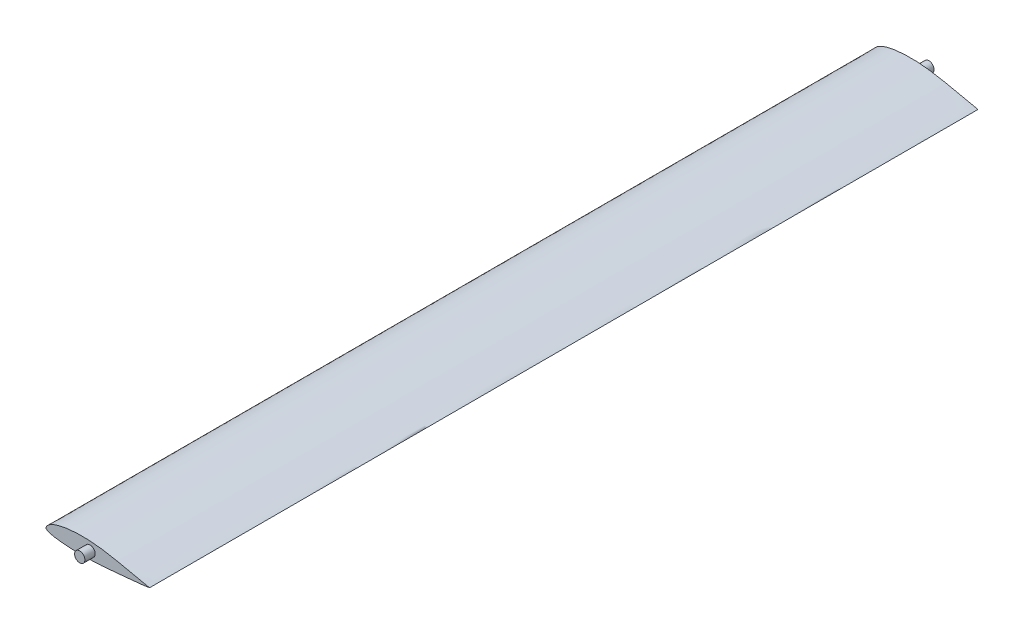
ISO-10303-21;
HEADER;
FILE_DESCRIPTION(('STEP AP214'),'2;1');
FILE_NAME('part.step','',(''),(''),'','','');
FILE_SCHEMA(('AUTOMOTIVE_DESIGN { 1 0 10303 214 1 1 1 1 }'));
ENDSEC;
DATA;
#1=APPLICATION_CONTEXT('core data for automotive mechanical design processes');
#2=APPLICATION_PROTOCOL_DEFINITION('international standard','automotive_design',2000,#1);
#3=PRODUCT_CONTEXT('',#1,'mechanical');
#4=PRODUCT('Part','Part','',(#3));
#5=PRODUCT_RELATED_PRODUCT_CATEGORY('part','',(#4));
#6=PRODUCT_DEFINITION_FORMATION('','',#4);
#7=PRODUCT_DEFINITION_CONTEXT('part definition',#1,'design');
#8=PRODUCT_DEFINITION('design','',#6,#7);
#9=PRODUCT_DEFINITION_SHAPE('','',#8);
#10=(LENGTH_UNIT() NAMED_UNIT(*) SI_UNIT(.MILLI.,.METRE.));
#11=(NAMED_UNIT(*) PLANE_ANGLE_UNIT() SI_UNIT($,.RADIAN.));
#12=(NAMED_UNIT(*) SI_UNIT($,.STERADIAN.) SOLID_ANGLE_UNIT());
#13=UNCERTAINTY_MEASURE_WITH_UNIT(LENGTH_MEASURE(1.E-05),#10,'distance_accuracy_value','');
#14=(GEOMETRIC_REPRESENTATION_CONTEXT(3) GLOBAL_UNCERTAINTY_ASSIGNED_CONTEXT((#13)) GLOBAL_UNIT_ASSIGNED_CONTEXT((#10,
#11,#12)) REPRESENTATION_CONTEXT('',''));
#15=CARTESIAN_POINT('',(0.,0.,0.));
#16=DIRECTION('',(0.,0.,1.));
#17=DIRECTION('',(1.,0.,0.));
#18=AXIS2_PLACEMENT_3D('',#15,#16,#17);
#19=CARTESIAN_POINT('',(50.,0.,200.));
#20=CARTESIAN_POINT('',(50.0001969134306,0.00515727259217131,200.));
#21=CARTESIAN_POINT('',(49.7517753348821,0.0352380854019029,200.));
#22=CARTESIAN_POINT('',(49.5184039700185,0.115966697103675,200.));
#23=CARTESIAN_POINT('',(48.9811339549746,0.254364807640285,200.));
#24=CARTESIAN_POINT('',(48.3474870900435,0.424151123007115,200.));
#25=CARTESIAN_POINT('',(47.5331841418867,0.603062225572845,200.));
#26=CARTESIAN_POINT('',(46.5740841644604,0.801914941759758,200.));
#27=CARTESIAN_POINT('',(45.4647124020037,1.02805692434749,200.));
#28=CARTESIAN_POINT('',(44.2203686917408,1.28179457049306,200.));
#29=CARTESIAN_POINT('',(42.8528888170686,1.5624765091469,200.));
#30=CARTESIAN_POINT('',(41.3768866735873,1.86748638758993,200.));
#31=CARTESIAN_POINT('',(39.806665540293,2.19428191342741,200.));
#32=CARTESIAN_POINT('',(38.1572753427591,2.5387663683399,200.));
#33=CARTESIAN_POINT('',(36.443935720422,2.89514667625882,200.));
#34=CARTESIAN_POINT('',(34.6820808326655,3.25747496343884,200.));
#35=CARTESIAN_POINT('',(32.8875527124629,3.61776834877319,200.));
#36=CARTESIAN_POINT('',(31.0741737172668,3.96797685596432,200.));
#37=CARTESIAN_POINT('',(29.2502552664222,4.28934258079803,200.));
#38=CARTESIAN_POINT('',(27.4226322155459,4.57193945664626,200.));
#39=CARTESIAN_POINT('',(25.5991248468563,4.81976573259398,200.));
#40=CARTESIAN_POINT('',(23.7845544408221,5.02123917141904,200.));
#41=CARTESIAN_POINT('',(21.9864919602989,5.17203778311767,200.));
#42=CARTESIAN_POINT('',(20.2117844944173,5.27741166746254,200.));
#43=CARTESIAN_POINT('',(18.4666173416627,5.32917038549656,200.));
#44=CARTESIAN_POINT('',(16.7576867552978,5.3326957357474,200.));
#45=CARTESIAN_POINT('',(15.092148479375,5.28937504643174,200.));
#46=CARTESIAN_POINT('',(13.4786922379033,5.19795184981273,200.));
#47=CARTESIAN_POINT('',(11.9250550260715,5.06488913193258,200.));
#48=CARTESIAN_POINT('',(10.439380849943,4.88989914134449,200.));
#49=CARTESIAN_POINT('',(9.02998646976024,4.67652427020381,200.));
#50=CARTESIAN_POINT('',(7.70428102065933,4.42641278079103,200.));
#51=CARTESIAN_POINT('',(6.46927270367325,4.1402751494596,200.));
#52=CARTESIAN_POINT('',(5.3305011794677,3.82312045001203,200.));
#53=CARTESIAN_POINT('',(4.29293361674335,3.4764701939327,200.));
#54=CARTESIAN_POINT('',(3.3624772788217,3.10085720826126,200.));
#55=CARTESIAN_POINT('',(2.53903719360374,2.70760788215811,200.));
#56=CARTESIAN_POINT('',(1.82850247884098,2.29432746346555,200.));
#57=CARTESIAN_POINT('',(1.23279382048125,1.87079774317508,200.));
#58=CARTESIAN_POINT('',(0.750625037022343,1.44393710167645,200.));
#59=CARTESIAN_POINT('',(0.390002488520812,1.01328341645625,200.));
#60=CARTESIAN_POINT('',(0.14199735138139,0.593616134300538,200.));
#61=CARTESIAN_POINT('',(0.00816110759566428,0.210408044580628,200.));
#62=CARTESIAN_POINT('',(-0.0184895201514866,-0.161269250903985,200.));
#63=CARTESIAN_POINT('',(0.213246281583359,-0.47511983606216,200.));
#64=CARTESIAN_POINT('',(0.595272522036934,-0.722527620532605,200.));
#65=CARTESIAN_POINT('',(1.12049183050509,-0.977510728821174,200.));
#66=CARTESIAN_POINT('',(1.79159049049624,-1.21937930400089,200.));
#67=CARTESIAN_POINT('',(2.60440375321895,-1.44514229221109,200.));
#68=CARTESIAN_POINT('',(3.55406668747624,-1.65479871494015,200.));
#69=CARTESIAN_POINT('',(4.63477552998271,-1.84945435325571,200.));
#70=CARTESIAN_POINT('',(5.84008833484079,-2.02353049280594,200.));
#71=CARTESIAN_POINT('',(7.16147102242245,-2.18133714449133,200.));
#72=CARTESIAN_POINT('',(8.59050502250438,-2.31933235723801,200.));
#73=CARTESIAN_POINT('',(10.1168457981679,-2.43815912513042,200.));
#74=CARTESIAN_POINT('',(11.7309936282205,-2.535294198223,200.));
#75=CARTESIAN_POINT('',(13.4228237617247,-2.60809080228019,200.));
#76=CARTESIAN_POINT('',(15.1820936437668,-2.65712345479106,200.));
#77=CARTESIAN_POINT('',(16.9985583194111,-2.67987339114275,200.));
#78=CARTESIAN_POINT('',(18.8620003143797,-2.67360338821193,200.));
#79=CARTESIAN_POINT('',(20.7624890636535,-2.64284301720883,200.));
#80=CARTESIAN_POINT('',(22.6906025589902,-2.58102458314004,200.));
#81=CARTESIAN_POINT('',(24.6358419678307,-2.49160550548097,200.));
#82=CARTESIAN_POINT('',(26.5895246560381,-2.37711616807963,200.));
#83=CARTESIAN_POINT('',(28.543070330579,-2.23432752921658,200.));
#84=CARTESIAN_POINT('',(30.4880736363383,-2.07139160658204,200.));
#85=CARTESIAN_POINT('',(32.4138411040915,-1.89969322848671,200.));
#86=CARTESIAN_POINT('',(34.3057949704879,-1.72052979920315,200.));
#87=CARTESIAN_POINT('',(36.1502236096922,-1.54125378777059,200.));
#88=CARTESIAN_POINT('',(37.9325880410994,-1.36393503812352,200.));
#89=CARTESIAN_POINT('',(39.6387489054084,-1.19369374820548,200.));
#90=CARTESIAN_POINT('',(41.2544064657769,-1.03171071245396,200.));
#91=CARTESIAN_POINT('',(42.7657412686067,-0.880312651730434,200.));
#92=CARTESIAN_POINT('',(44.1593778046206,-0.740822324164999,200.));
#93=CARTESIAN_POINT('',(45.4223860391926,-0.6145759398259,200.));
#94=CARTESIAN_POINT('',(46.543867462236,-0.498488284948712,200.));
#95=CARTESIAN_POINT('',(47.5102480482749,-0.39241073266339,200.));
#96=CARTESIAN_POINT('',(48.3294146373038,-0.28862471004581,200.));
#97=CARTESIAN_POINT('',(48.968878442007,-0.173192254215331,200.));
#98=CARTESIAN_POINT('',(49.5117512519439,-0.0786090400018284,200.));
#99=CARTESIAN_POINT('',(49.7496033675591,-0.0142702732137088,200.));
#100=CARTESIAN_POINT('',(49.9998028569116,-0.00516328745349753,200.));
#101=CARTESIAN_POINT('',(50.,0.,200.));
#102=B_SPLINE_CURVE_WITH_KNOTS('',3,(#19,#20,#21,#22,#23,#24,#25,#26,#27,#28,#29,#30,#31,#32,
#33,#34,#35,#36,#37,#38,#39,#40,#41,#42,#43,#44,#45,#46,#47,#48,#49,#50,#51,#52,#53,#54,#55,#56,
#57,#58,#59,#60,#61,#62,#63,#64,#65,#66,#67,#68,#69,#70,#71,#72,#73,#74,#75,#76,#77,#78,#79,#80,
#81,#82,#83,#84,#85,#86,#87,#88,#89,#90,#91,#92,#93,#94,#95,#96,#97,#98,#99,#100,#101),
.UNSPECIFIED.,.T.,.F.,(4,1,1,1,1,1,1,1,1,1,1,1,1,1,1,1,1,1,1,1,1,1,1,1,1,1,1,1,1,1,1,1,1,1,1,1,
1,1,1,1,1,1,1,1,1,1,1,1,1,1,1,1,1,1,1,1,1,1,1,1,1,1,1,1,1,1,1,1,1,1,1,1,1,1,1,1,1,1,1,1,4),(0.,
0.00119446441199182,0.00453955461471709,0.00960052276025812,0.0161351261947153,
0.024161430649025,0.0337276450994223,0.0447632380536713,0.0571569391409702,0.0707687217854112,
0.0854709239458352,0.101110136232044,0.117540482853584,0.134608346901148,0.152143929261613,
0.169994788255357,0.187984495603867,0.206001687322408,0.223999555029317,0.241911620466177,
0.259663880475156,0.277234721039043,0.294525323071495,0.311502719414129,0.328142294532378,
0.34435524054095,0.360082319405339,0.375262468857628,0.389821447324272,0.403699303832544,
0.416823540163742,0.429153753227181,0.440657396752527,0.451284209700999,0.46103767622991,
0.469901238602895,0.477873379193299,0.484976797491884,0.491187224332085,0.496596218332954,
0.501303285597371,0.505289755053579,0.508453442808194,0.511642850740302,0.516040389336983,
0.521704123051791,0.528624601169125,0.536816542079547,0.546288662988098,0.556976167313028,
0.568832207351503,0.581797357423799,0.595780906543627,0.61069645026715,0.626440919855375,
0.64293537470542,0.660077102547952,0.677762784608206,0.695908937672858,0.714417309362768,
0.733190222645514,0.752163165157898,0.771202799178643,0.790259419553038,0.8092827236897,
0.828121153070206,0.846641150496278,0.864702524810814,0.882161821375539,0.898874989027893,
0.914704700967389,0.929513624789158,0.943169748766346,0.9555468702104,0.966535802765005,
0.976027755551179,0.983961125002191,0.990430108950002,0.995460616464935,0.99880414249938,1.),.UNSPECIFIED.);
#103=DIRECTION('',(0.,0.,-1.));
#104=VECTOR('',#103,1.);
#105=SURFACE_OF_LINEAR_EXTRUSION('',#102,#104);
#106=CARTESIAN_POINT('',(50.,0.,200.));
#107=VERTEX_POINT('',#106);
#108=EDGE_CURVE('E43',#107,#107,#102,.T.);
#109=ORIENTED_EDGE('',*,*,#108,.F.);
#110=EDGE_LOOP('',(#109));
#111=FACE_BOUND('',#110,.T.);
#112=CARTESIAN_POINT('',(50.,0.,-200.));
#113=CARTESIAN_POINT('',(50.0001969134306,0.00515727259217131,-200.));
#114=CARTESIAN_POINT('',(49.7517753348821,0.0352380854019029,-200.));
#115=CARTESIAN_POINT('',(49.5184039700185,0.115966697103675,-200.));
#116=CARTESIAN_POINT('',(48.9811339549746,0.254364807640285,-200.));
#117=CARTESIAN_POINT('',(48.3474870900435,0.424151123007115,-200.));
#118=CARTESIAN_POINT('',(47.5331841418867,0.603062225572845,-200.));
#119=CARTESIAN_POINT('',(46.5740841644604,0.801914941759758,-200.));
#120=CARTESIAN_POINT('',(45.4647124020037,1.02805692434749,-200.));
#121=CARTESIAN_POINT('',(44.2203686917408,1.28179457049306,-200.));
#122=CARTESIAN_POINT('',(42.8528888170686,1.5624765091469,-200.));
#123=CARTESIAN_POINT('',(41.3768866735873,1.86748638758993,-200.));
#124=CARTESIAN_POINT('',(39.806665540293,2.19428191342741,-200.));
#125=CARTESIAN_POINT('',(38.1572753427591,2.5387663683399,-200.));
#126=CARTESIAN_POINT('',(36.443935720422,2.89514667625882,-200.));
#127=CARTESIAN_POINT('',(34.6820808326655,3.25747496343884,-200.));
#128=CARTESIAN_POINT('',(32.8875527124629,3.61776834877319,-200.));
#129=CARTESIAN_POINT('',(31.0741737172668,3.96797685596432,-200.));
#130=CARTESIAN_POINT('',(29.2502552664222,4.28934258079803,-200.));
#131=CARTESIAN_POINT('',(27.4226322155459,4.57193945664626,-200.));
#132=CARTESIAN_POINT('',(25.5991248468563,4.81976573259398,-200.));
#133=CARTESIAN_POINT('',(23.7845544408221,5.02123917141904,-200.));
#134=CARTESIAN_POINT('',(21.9864919602989,5.17203778311767,-200.));
#135=CARTESIAN_POINT('',(20.2117844944173,5.27741166746254,-200.));
#136=CARTESIAN_POINT('',(18.4666173416627,5.32917038549656,-200.));
#137=CARTESIAN_POINT('',(16.7576867552978,5.3326957357474,-200.));
#138=CARTESIAN_POINT('',(15.092148479375,5.28937504643174,-200.));
#139=CARTESIAN_POINT('',(13.4786922379033,5.19795184981273,-200.));
#140=CARTESIAN_POINT('',(11.9250550260715,5.06488913193258,-200.));
#141=CARTESIAN_POINT('',(10.439380849943,4.88989914134449,-200.));
#142=CARTESIAN_POINT('',(9.02998646976024,4.67652427020381,-200.));
#143=CARTESIAN_POINT('',(7.70428102065933,4.42641278079103,-200.));
#144=CARTESIAN_POINT('',(6.46927270367325,4.1402751494596,-200.));
#145=CARTESIAN_POINT('',(5.3305011794677,3.82312045001203,-200.));
#146=CARTESIAN_POINT('',(4.29293361674335,3.4764701939327,-200.));
#147=CARTESIAN_POINT('',(3.3624772788217,3.10085720826126,-200.));
#148=CARTESIAN_POINT('',(2.53903719360374,2.70760788215811,-200.));
#149=CARTESIAN_POINT('',(1.82850247884098,2.29432746346555,-200.));
#150=CARTESIAN_POINT('',(1.23279382048125,1.87079774317508,-200.));
#151=CARTESIAN_POINT('',(0.750625037022343,1.44393710167645,-200.));
#152=CARTESIAN_POINT('',(0.390002488520812,1.01328341645625,-200.));
#153=CARTESIAN_POINT('',(0.14199735138139,0.593616134300538,-200.));
#154=CARTESIAN_POINT('',(0.00816110759566428,0.210408044580628,-200.));
#155=CARTESIAN_POINT('',(-0.0184895201514866,-0.161269250903985,-200.));
#156=CARTESIAN_POINT('',(0.213246281583359,-0.47511983606216,-200.));
#157=CARTESIAN_POINT('',(0.595272522036934,-0.722527620532605,-200.));
#158=CARTESIAN_POINT('',(1.12049183050509,-0.977510728821174,-200.));
#159=CARTESIAN_POINT('',(1.79159049049624,-1.21937930400089,-200.));
#160=CARTESIAN_POINT('',(2.60440375321895,-1.44514229221109,-200.));
#161=CARTESIAN_POINT('',(3.55406668747624,-1.65479871494015,-200.));
#162=CARTESIAN_POINT('',(4.63477552998271,-1.84945435325571,-200.));
#163=CARTESIAN_POINT('',(5.84008833484079,-2.02353049280594,-200.));
#164=CARTESIAN_POINT('',(7.16147102242245,-2.18133714449133,-200.));
#165=CARTESIAN_POINT('',(8.59050502250438,-2.31933235723801,-200.));
#166=CARTESIAN_POINT('',(10.1168457981679,-2.43815912513042,-200.));
#167=CARTESIAN_POINT('',(11.7309936282205,-2.535294198223,-200.));
#168=CARTESIAN_POINT('',(13.4228237617247,-2.60809080228019,-200.));
#169=CARTESIAN_POINT('',(15.1820936437668,-2.65712345479106,-200.));
#170=CARTESIAN_POINT('',(16.9985583194111,-2.67987339114275,-200.));
#171=CARTESIAN_POINT('',(18.8620003143797,-2.67360338821193,-200.));
#172=CARTESIAN_POINT('',(20.7624890636535,-2.64284301720883,-200.));
#173=CARTESIAN_POINT('',(22.6906025589902,-2.58102458314004,-200.));
#174=CARTESIAN_POINT('',(24.6358419678307,-2.49160550548097,-200.));
#175=CARTESIAN_POINT('',(26.5895246560381,-2.37711616807963,-200.));
#176=CARTESIAN_POINT('',(28.543070330579,-2.23432752921658,-200.));
#177=CARTESIAN_POINT('',(30.4880736363383,-2.07139160658204,-200.));
#178=CARTESIAN_POINT('',(32.4138411040915,-1.89969322848671,-200.));
#179=CARTESIAN_POINT('',(34.3057949704879,-1.72052979920315,-200.));
#180=CARTESIAN_POINT('',(36.1502236096922,-1.54125378777059,-200.));
#181=CARTESIAN_POINT('',(37.9325880410994,-1.36393503812352,-200.));
#182=CARTESIAN_POINT('',(39.6387489054084,-1.19369374820548,-200.));
#183=CARTESIAN_POINT('',(41.2544064657769,-1.03171071245396,-200.));
#184=CARTESIAN_POINT('',(42.7657412686067,-0.880312651730434,-200.));
#185=CARTESIAN_POINT('',(44.1593778046206,-0.740822324164999,-200.));
#186=CARTESIAN_POINT('',(45.4223860391926,-0.6145759398259,-200.));
#187=CARTESIAN_POINT('',(46.543867462236,-0.498488284948712,-200.));
#188=CARTESIAN_POINT('',(47.5102480482749,-0.39241073266339,-200.));
#189=CARTESIAN_POINT('',(48.3294146373038,-0.28862471004581,-200.));
#190=CARTESIAN_POINT('',(48.968878442007,-0.173192254215331,-200.));
#191=CARTESIAN_POINT('',(49.5117512519439,-0.0786090400018284,-200.));
#192=CARTESIAN_POINT('',(49.7496033675591,-0.0142702732137088,-200.));
#193=CARTESIAN_POINT('',(49.9998028569116,-0.00516328745349753,-200.));
#194=CARTESIAN_POINT('',(50.,0.,-200.));
#195=B_SPLINE_CURVE_WITH_KNOTS('',3,(#112,#113,#114,#115,#116,#117,#118,#119,#120,#121,#122,
#123,#124,#125,#126,#127,#128,#129,#130,#131,#132,#133,#134,#135,#136,#137,#138,#139,#140,#141,
#142,#143,#144,#145,#146,#147,#148,#149,#150,#151,#152,#153,#154,#155,#156,#157,#158,#159,#160,
#161,#162,#163,#164,#165,#166,#167,#168,#169,#170,#171,#172,#173,#174,#175,#176,#177,#178,#179,
#180,#181,#182,#183,#184,#185,#186,#187,#188,#189,#190,#191,#192,#193,#194),.UNSPECIFIED.,.T.,
.F.,(4,1,1,1,1,1,1,1,1,1,1,1,1,1,1,1,1,1,1,1,1,1,1,1,1,1,1,1,1,1,1,1,1,1,1,1,1,1,1,1,1,1,1,1,1,
1,1,1,1,1,1,1,1,1,1,1,1,1,1,1,1,1,1,1,1,1,1,1,1,1,1,1,1,1,1,1,1,1,1,1,4),(0.,
0.00119446441199182,0.00453955461471709,0.00960052276025812,0.0161351261947153,
0.024161430649025,0.0337276450994223,0.0447632380536713,0.0571569391409702,0.0707687217854112,
0.0854709239458352,0.101110136232044,0.117540482853584,0.134608346901148,0.152143929261613,
0.169994788255357,0.187984495603867,0.206001687322408,0.223999555029317,0.241911620466177,
0.259663880475156,0.277234721039043,0.294525323071495,0.311502719414129,0.328142294532378,
0.34435524054095,0.360082319405339,0.375262468857628,0.389821447324272,0.403699303832544,
0.416823540163742,0.429153753227181,0.440657396752527,0.451284209700999,0.46103767622991,
0.469901238602895,0.477873379193299,0.484976797491884,0.491187224332085,0.496596218332954,
0.501303285597371,0.505289755053579,0.508453442808194,0.511642850740302,0.516040389336983,
0.521704123051791,0.528624601169125,0.536816542079547,0.546288662988098,0.556976167313028,
0.568832207351503,0.581797357423799,0.595780906543627,0.61069645026715,0.626440919855375,
0.64293537470542,0.660077102547952,0.677762784608206,0.695908937672858,0.714417309362768,
0.733190222645514,0.752163165157898,0.771202799178643,0.790259419553038,0.8092827236897,
0.828121153070206,0.846641150496278,0.864702524810814,0.882161821375539,0.898874989027893,
0.914704700967389,0.929513624789158,0.943169748766346,0.9555468702104,0.966535802765005,
0.976027755551179,0.983961125002191,0.990430108950002,0.995460616464935,0.99880414249938,1.),.UNSPECIFIED.);
#196=CARTESIAN_POINT('',(50.,0.,-200.));
#197=VERTEX_POINT('',#196);
#198=EDGE_CURVE('E47',#197,#197,#195,.T.);
#199=ORIENTED_EDGE('',*,*,#198,.T.);
#200=EDGE_LOOP('',(#199));
#201=FACE_BOUND('',#200,.T.);
#202=ADVANCED_FACE('F36',(#111,#201),#105,.F.);
#203=CARTESIAN_POINT('',(0.204362382373743,0.68589860080384,200.));
#204=DIRECTION('',(0.,0.,-1.));
#205=DIRECTION('',(-1.,0.,0.));
#206=AXIS2_PLACEMENT_3D('',#203,#204,#205);
#207=PLANE('',#206);
#208=CARTESIAN_POINT('',(21.2825865188505,1.04388994361072,200.));
#209=DIRECTION('',(0.,0.,-1.));
#210=DIRECTION('',(-1.,0.,0.));
#211=AXIS2_PLACEMENT_3D('',#208,#209,#210);
#212=CIRCLE('',#211,2.5);
#213=CARTESIAN_POINT('',(18.7825865188505,1.04388994361072,200.));
#214=VERTEX_POINT('',#213);
#215=EDGE_CURVE('E56',#214,#214,#212,.T.);
#216=ORIENTED_EDGE('',*,*,#215,.T.);
#217=EDGE_LOOP('',(#216));
#218=FACE_BOUND('',#217,.T.);
#219=ORIENTED_EDGE('',*,*,#108,.T.);
#220=EDGE_LOOP('',(#219));
#221=FACE_BOUND('',#220,.T.);
#222=ADVANCED_FACE('F88',(#218,#221),#207,.F.);
#223=CARTESIAN_POINT('',(0.204362382373743,0.68589860080384,-200.));
#224=DIRECTION('',(0.,0.,-1.));
#225=DIRECTION('',(-1.,0.,0.));
#226=AXIS2_PLACEMENT_3D('',#223,#224,#225);
#227=PLANE('',#226);
#228=CARTESIAN_POINT('',(21.2825865188505,1.04388994361072,-200.));
#229=DIRECTION('',(0.,0.,-1.));
#230=DIRECTION('',(-1.,0.,0.));
#231=AXIS2_PLACEMENT_3D('',#228,#229,#230);
#232=CIRCLE('',#231,2.5);
#233=CARTESIAN_POINT('',(18.7825865188505,1.04388994361072,-200.));
#234=VERTEX_POINT('',#233);
#235=EDGE_CURVE('E10',#234,#234,#232,.T.);
#236=ORIENTED_EDGE('',*,*,#235,.F.);
#237=EDGE_LOOP('',(#236));
#238=FACE_BOUND('',#237,.T.);
#239=ORIENTED_EDGE('',*,*,#198,.F.);
#240=EDGE_LOOP('',(#239));
#241=FACE_BOUND('',#240,.T.);
#242=ADVANCED_FACE('F93',(#238,#241),#227,.T.);
#243=CARTESIAN_POINT('',(21.2825865188505,1.04388994361072,205.));
#244=DIRECTION('',(0.,0.,-1.));
#245=DIRECTION('',(-1.,0.,0.));
#246=AXIS2_PLACEMENT_3D('',#243,#244,#245);
#247=CYLINDRICAL_SURFACE('',#246,2.5);
#248=CARTESIAN_POINT('',(21.2825865188505,1.04388994361072,205.));
#249=DIRECTION('',(0.,0.,-1.));
#250=DIRECTION('',(-1.,0.,0.));
#251=AXIS2_PLACEMENT_3D('',#248,#249,#250);
#252=CIRCLE('',#251,2.5);
#253=CARTESIAN_POINT('',(18.7825865188505,1.04388994361072,205.));
#254=VERTEX_POINT('',#253);
#255=EDGE_CURVE('E51',#254,#254,#252,.T.);
#256=ORIENTED_EDGE('',*,*,#255,.T.);
#257=EDGE_LOOP('',(#256));
#258=FACE_BOUND('',#257,.T.);
#259=ORIENTED_EDGE('',*,*,#215,.F.);
#260=EDGE_LOOP('',(#259));
#261=FACE_BOUND('',#260,.T.);
#262=ADVANCED_FACE('F84',(#258,#261),#247,.T.);
#263=CARTESIAN_POINT('',(21.2825865188505,1.04388994361072,205.));
#264=DIRECTION('',(0.,0.,-1.));
#265=DIRECTION('',(-1.,0.,0.));
#266=AXIS2_PLACEMENT_3D('',#263,#264,#265);
#267=PLANE('',#266);
#268=ORIENTED_EDGE('',*,*,#255,.F.);
#269=EDGE_LOOP('',(#268));
#270=FACE_BOUND('',#269,.T.);
#271=ADVANCED_FACE('F77',(#270),#267,.F.);
#272=CARTESIAN_POINT('',(21.2825865188505,1.04388994361072,-205.));
#273=DIRECTION('',(0.,0.,1.));
#274=DIRECTION('',(-1.,0.,0.));
#275=AXIS2_PLACEMENT_3D('',#272,#273,#274);
#276=CYLINDRICAL_SURFACE('',#275,2.5);
#277=CARTESIAN_POINT('',(21.2825865188505,1.04388994361072,-205.));
#278=DIRECTION('',(0.,0.,-1.));
#279=DIRECTION('',(-1.,0.,0.));
#280=AXIS2_PLACEMENT_3D('',#277,#278,#279);
#281=CIRCLE('',#280,2.5);
#282=CARTESIAN_POINT('',(18.7825865188505,1.04388994361072,-205.));
#283=VERTEX_POINT('',#282);
#284=EDGE_CURVE('E67',#283,#283,#281,.T.);
#285=ORIENTED_EDGE('',*,*,#284,.F.);
#286=EDGE_LOOP('',(#285));
#287=FACE_BOUND('',#286,.T.);
#288=ORIENTED_EDGE('',*,*,#235,.T.);
#289=EDGE_LOOP('',(#288));
#290=FACE_BOUND('',#289,.T.);
#291=ADVANCED_FACE('F75',(#287,#290),#276,.T.);
#292=CARTESIAN_POINT('',(21.2825865188505,1.04388994361072,-205.));
#293=DIRECTION('',(0.,0.,1.));
#294=DIRECTION('',(-1.,0.,0.));
#295=AXIS2_PLACEMENT_3D('',#292,#293,#294);
#296=PLANE('',#295);
#297=ORIENTED_EDGE('',*,*,#284,.T.);
#298=EDGE_LOOP('',(#297));
#299=FACE_BOUND('',#298,.T.);
#300=ADVANCED_FACE('F73',(#299),#296,.F.);
#301=CLOSED_SHELL('',(#202,#222,#242,#262,#271,#291,#300));
#302=MANIFOLD_SOLID_BREP('B2',#301);
#303=ADVANCED_BREP_SHAPE_REPRESENTATION('',(#18,#302),#14);
#304=SHAPE_DEFINITION_REPRESENTATION(#9,#303);
ENDSEC;
END-ISO-10303-21;
